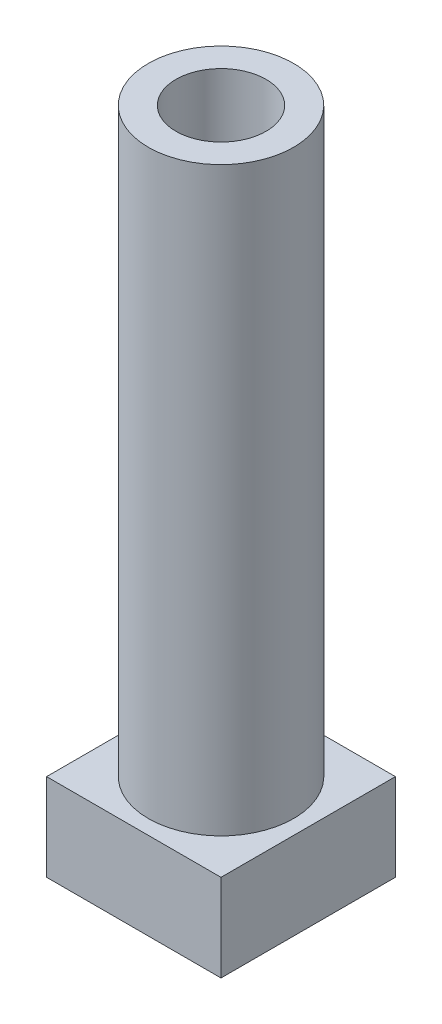
ISO-10303-21;
HEADER;
FILE_DESCRIPTION(('STEP AP214'),'2;1');
FILE_NAME('part.step','',(''),(''),'','','');
FILE_SCHEMA(('AUTOMOTIVE_DESIGN { 1 0 10303 214 1 1 1 1 }'));
ENDSEC;
DATA;
#1=APPLICATION_CONTEXT('core data for automotive mechanical design processes');
#2=APPLICATION_PROTOCOL_DEFINITION('international standard','automotive_design',2000,#1);
#3=PRODUCT_CONTEXT('',#1,'mechanical');
#4=PRODUCT('Part','Part','',(#3));
#5=PRODUCT_RELATED_PRODUCT_CATEGORY('part','',(#4));
#6=PRODUCT_DEFINITION_FORMATION('','',#4);
#7=PRODUCT_DEFINITION_CONTEXT('part definition',#1,'design');
#8=PRODUCT_DEFINITION('design','',#6,#7);
#9=PRODUCT_DEFINITION_SHAPE('','',#8);
#10=(LENGTH_UNIT() NAMED_UNIT(*) SI_UNIT(.MILLI.,.METRE.));
#11=(NAMED_UNIT(*) PLANE_ANGLE_UNIT() SI_UNIT($,.RADIAN.));
#12=(NAMED_UNIT(*) SI_UNIT($,.STERADIAN.) SOLID_ANGLE_UNIT());
#13=UNCERTAINTY_MEASURE_WITH_UNIT(LENGTH_MEASURE(1.E-05),#10,'distance_accuracy_value','');
#14=(GEOMETRIC_REPRESENTATION_CONTEXT(3) GLOBAL_UNCERTAINTY_ASSIGNED_CONTEXT((#13)) GLOBAL_UNIT_ASSIGNED_CONTEXT((#10,
#11,#12)) REPRESENTATION_CONTEXT('',''));
#15=CARTESIAN_POINT('',(0.,0.,0.));
#16=DIRECTION('',(0.,0.,1.));
#17=DIRECTION('',(1.,0.,0.));
#18=AXIS2_PLACEMENT_3D('',#15,#16,#17);
#19=CARTESIAN_POINT('',(0.,-3.,3.));
#20=DIRECTION('',(0.,0.,1.));
#21=DIRECTION('',(1.,0.,0.));
#22=AXIS2_PLACEMENT_3D('',#19,#20,#21);
#23=PLANE('',#22);
#24=DIRECTION('',(1.,0.,0.));
#25=VECTOR('',#24,1.);
#26=CARTESIAN_POINT('',(0.,0.,3.));
#27=LINE('',#26,#25);
#28=CARTESIAN_POINT('',(-3.,0.,3.));
#29=VERTEX_POINT('',#28);
#30=CARTESIAN_POINT('',(3.,0.,3.));
#31=VERTEX_POINT('',#30);
#32=EDGE_CURVE('E113',#29,#31,#27,.T.);
#33=ORIENTED_EDGE('',*,*,#32,.F.);
#34=DIRECTION('',(0.,1.,0.));
#35=VECTOR('',#34,1.);
#36=CARTESIAN_POINT('',(-3.,-3.,3.));
#37=LINE('',#36,#35);
#38=CARTESIAN_POINT('',(-3.,-3.,3.));
#39=VERTEX_POINT('',#38);
#40=EDGE_CURVE('E11',#39,#29,#37,.T.);
#41=ORIENTED_EDGE('',*,*,#40,.F.);
#42=DIRECTION('',(1.,0.,0.));
#43=VECTOR('',#42,1.);
#44=CARTESIAN_POINT('',(0.,-3.,3.));
#45=LINE('',#44,#43);
#46=CARTESIAN_POINT('',(3.,-3.,3.));
#47=VERTEX_POINT('',#46);
#48=EDGE_CURVE('E105',#39,#47,#45,.T.);
#49=ORIENTED_EDGE('',*,*,#48,.T.);
#50=DIRECTION('',(0.,1.,0.));
#51=VECTOR('',#50,1.);
#52=CARTESIAN_POINT('',(3.,-3.,3.));
#53=LINE('',#52,#51);
#54=EDGE_CURVE('E44',#47,#31,#53,.T.);
#55=ORIENTED_EDGE('',*,*,#54,.T.);
#56=EDGE_LOOP('',(#33,#41,#49,#55));
#57=FACE_BOUND('',#56,.T.);
#58=ADVANCED_FACE('F41',(#57),#23,.T.);
#59=CARTESIAN_POINT('',(-3.,-3.,0.));
#60=DIRECTION('',(1.,0.,0.));
#61=DIRECTION('',(0.,0.,-1.));
#62=AXIS2_PLACEMENT_3D('',#59,#60,#61);
#63=PLANE('',#62);
#64=DIRECTION('',(0.,0.,-1.));
#65=VECTOR('',#64,1.);
#66=CARTESIAN_POINT('',(-3.,0.,0.));
#67=LINE('',#66,#65);
#68=CARTESIAN_POINT('',(-3.,0.,-3.));
#69=VERTEX_POINT('',#68);
#70=EDGE_CURVE('E75',#29,#69,#67,.T.);
#71=ORIENTED_EDGE('',*,*,#70,.T.);
#72=DIRECTION('',(0.,1.,0.));
#73=VECTOR('',#72,1.);
#74=CARTESIAN_POINT('',(-3.,-3.,-3.));
#75=LINE('',#74,#73);
#76=CARTESIAN_POINT('',(-3.,-3.,-3.));
#77=VERTEX_POINT('',#76);
#78=EDGE_CURVE('E51',#77,#69,#75,.T.);
#79=ORIENTED_EDGE('',*,*,#78,.F.);
#80=DIRECTION('',(0.,0.,-1.));
#81=VECTOR('',#80,1.);
#82=CARTESIAN_POINT('',(-3.,-3.,0.));
#83=LINE('',#82,#81);
#84=EDGE_CURVE('E92',#39,#77,#83,.T.);
#85=ORIENTED_EDGE('',*,*,#84,.F.);
#86=ORIENTED_EDGE('',*,*,#40,.T.);
#87=EDGE_LOOP('',(#71,#79,#85,#86));
#88=FACE_BOUND('',#87,.T.);
#89=ADVANCED_FACE('F130',(#88),#63,.F.);
#90=CARTESIAN_POINT('',(0.,-3.,-3.));
#91=DIRECTION('',(0.,0.,1.));
#92=DIRECTION('',(1.,0.,0.));
#93=AXIS2_PLACEMENT_3D('',#90,#91,#92);
#94=PLANE('',#93);
#95=DIRECTION('',(1.,0.,0.));
#96=VECTOR('',#95,1.);
#97=CARTESIAN_POINT('',(0.,0.,-3.));
#98=LINE('',#97,#96);
#99=CARTESIAN_POINT('',(3.,0.,-3.));
#100=VERTEX_POINT('',#99);
#101=EDGE_CURVE('E100',#69,#100,#98,.T.);
#102=ORIENTED_EDGE('',*,*,#101,.T.);
#103=DIRECTION('',(0.,1.,0.));
#104=VECTOR('',#103,1.);
#105=CARTESIAN_POINT('',(3.,-3.,-3.));
#106=LINE('',#105,#104);
#107=CARTESIAN_POINT('',(3.,-3.,-3.));
#108=VERTEX_POINT('',#107);
#109=EDGE_CURVE('E97',#108,#100,#106,.T.);
#110=ORIENTED_EDGE('',*,*,#109,.F.);
#111=DIRECTION('',(1.,0.,0.));
#112=VECTOR('',#111,1.);
#113=CARTESIAN_POINT('',(0.,-3.,-3.));
#114=LINE('',#113,#112);
#115=EDGE_CURVE('E87',#77,#108,#114,.T.);
#116=ORIENTED_EDGE('',*,*,#115,.F.);
#117=ORIENTED_EDGE('',*,*,#78,.T.);
#118=EDGE_LOOP('',(#102,#110,#116,#117));
#119=FACE_BOUND('',#118,.T.);
#120=ADVANCED_FACE('F98',(#119),#94,.F.);
#121=CARTESIAN_POINT('',(3.,-3.,0.));
#122=DIRECTION('',(1.,0.,0.));
#123=DIRECTION('',(0.,0.,-1.));
#124=AXIS2_PLACEMENT_3D('',#121,#122,#123);
#125=PLANE('',#124);
#126=DIRECTION('',(0.,0.,-1.));
#127=VECTOR('',#126,1.);
#128=CARTESIAN_POINT('',(3.,0.,0.));
#129=LINE('',#128,#127);
#130=EDGE_CURVE('E117',#31,#100,#129,.T.);
#131=ORIENTED_EDGE('',*,*,#130,.F.);
#132=ORIENTED_EDGE('',*,*,#54,.F.);
#133=DIRECTION('',(0.,0.,-1.));
#134=VECTOR('',#133,1.);
#135=CARTESIAN_POINT('',(3.,-3.,0.));
#136=LINE('',#135,#134);
#137=EDGE_CURVE('E91',#47,#108,#136,.T.);
#138=ORIENTED_EDGE('',*,*,#137,.T.);
#139=ORIENTED_EDGE('',*,*,#109,.T.);
#140=EDGE_LOOP('',(#131,#132,#138,#139));
#141=FACE_BOUND('',#140,.T.);
#142=ADVANCED_FACE('F103',(#141),#125,.T.);
#143=CARTESIAN_POINT('',(0.,-3.,0.));
#144=DIRECTION('',(0.,1.,0.));
#145=DIRECTION('',(0.,0.,1.));
#146=AXIS2_PLACEMENT_3D('',#143,#144,#145);
#147=PLANE('',#146);
#148=ORIENTED_EDGE('',*,*,#48,.F.);
#149=ORIENTED_EDGE('',*,*,#84,.T.);
#150=ORIENTED_EDGE('',*,*,#115,.T.);
#151=ORIENTED_EDGE('',*,*,#137,.F.);
#152=EDGE_LOOP('',(#148,#149,#150,#151));
#153=FACE_BOUND('',#152,.T.);
#154=ADVANCED_FACE('F90',(#153),#147,.F.);
#155=CARTESIAN_POINT('',(0.,0.,0.));
#156=DIRECTION('',(0.,1.,0.));
#157=DIRECTION('',(0.,0.,1.));
#158=AXIS2_PLACEMENT_3D('',#155,#156,#157);
#159=PLANE('',#158);
#160=CARTESIAN_POINT('',(0.,0.,0.));
#161=DIRECTION('',(0.,1.,0.));
#162=DIRECTION('',(0.,0.,1.));
#163=AXIS2_PLACEMENT_3D('',#160,#161,#162);
#164=CIRCLE('',#163,2.5);
#165=CARTESIAN_POINT('',(0.,0.,2.5));
#166=VERTEX_POINT('',#165);
#167=EDGE_CURVE('E179',#166,#166,#164,.T.);
#168=ORIENTED_EDGE('',*,*,#167,.F.);
#169=EDGE_LOOP('',(#168));
#170=FACE_BOUND('',#169,.T.);
#171=ORIENTED_EDGE('',*,*,#32,.T.);
#172=ORIENTED_EDGE('',*,*,#130,.T.);
#173=ORIENTED_EDGE('',*,*,#101,.F.);
#174=ORIENTED_EDGE('',*,*,#70,.F.);
#175=EDGE_LOOP('',(#171,#172,#173,#174));
#176=FACE_BOUND('',#175,.T.);
#177=ADVANCED_FACE('F127',(#170,#176),#159,.T.);
#178=CARTESIAN_POINT('',(0.,20.,0.));
#179=DIRECTION('',(0.,-1.,0.));
#180=DIRECTION('',(0.,0.,-1.));
#181=AXIS2_PLACEMENT_3D('',#178,#179,#180);
#182=CYLINDRICAL_SURFACE('',#181,1.55);
#183=CARTESIAN_POINT('',(0.,3.,0.));
#184=DIRECTION('',(0.,1.,0.));
#185=DIRECTION('',(0.,0.,1.));
#186=AXIS2_PLACEMENT_3D('',#183,#184,#185);
#187=CIRCLE('',#186,1.55);
#188=CARTESIAN_POINT('',(0.,3.,1.55));
#189=VERTEX_POINT('',#188);
#190=EDGE_CURVE('E118',#189,#189,#187,.F.);
#191=ORIENTED_EDGE('',*,*,#190,.T.);
#192=EDGE_LOOP('',(#191));
#193=FACE_BOUND('',#192,.T.);
#194=CARTESIAN_POINT('',(0.,20.,0.));
#195=DIRECTION('',(0.,1.,0.));
#196=DIRECTION('',(0.,0.,1.));
#197=AXIS2_PLACEMENT_3D('',#194,#195,#196);
#198=CIRCLE('',#197,1.55);
#199=CARTESIAN_POINT('',(0.,20.,1.55));
#200=VERTEX_POINT('',#199);
#201=EDGE_CURVE('E170',#200,#200,#198,.T.);
#202=ORIENTED_EDGE('',*,*,#201,.T.);
#203=EDGE_LOOP('',(#202));
#204=FACE_BOUND('',#203,.T.);
#205=ADVANCED_FACE('F148',(#193,#204),#182,.F.);
#206=CARTESIAN_POINT('',(0.,20.,0.));
#207=DIRECTION('',(0.,-1.,0.));
#208=DIRECTION('',(0.,0.,-1.));
#209=AXIS2_PLACEMENT_3D('',#206,#207,#208);
#210=CYLINDRICAL_SURFACE('',#209,2.5);
#211=CARTESIAN_POINT('',(0.,20.,0.));
#212=DIRECTION('',(0.,1.,0.));
#213=DIRECTION('',(0.,0.,1.));
#214=AXIS2_PLACEMENT_3D('',#211,#212,#213);
#215=CIRCLE('',#214,2.5);
#216=CARTESIAN_POINT('',(0.,20.,2.5));
#217=VERTEX_POINT('',#216);
#218=EDGE_CURVE('E173',#217,#217,#215,.T.);
#219=ORIENTED_EDGE('',*,*,#218,.F.);
#220=EDGE_LOOP('',(#219));
#221=FACE_BOUND('',#220,.T.);
#222=ORIENTED_EDGE('',*,*,#167,.T.);
#223=EDGE_LOOP('',(#222));
#224=FACE_BOUND('',#223,.T.);
#225=ADVANCED_FACE('F158',(#221,#224),#210,.T.);
#226=CARTESIAN_POINT('',(0.,20.,0.));
#227=DIRECTION('',(0.,1.,0.));
#228=DIRECTION('',(0.,0.,1.));
#229=AXIS2_PLACEMENT_3D('',#226,#227,#228);
#230=PLANE('',#229);
#231=ORIENTED_EDGE('',*,*,#201,.F.);
#232=EDGE_LOOP('',(#231));
#233=FACE_BOUND('',#232,.T.);
#234=ORIENTED_EDGE('',*,*,#218,.T.);
#235=EDGE_LOOP('',(#234));
#236=FACE_BOUND('',#235,.T.);
#237=ADVANCED_FACE('F154',(#233,#236),#230,.T.);
#238=CARTESIAN_POINT('',(0.,3.,0.));
#239=DIRECTION('',(0.,1.,0.));
#240=DIRECTION('',(0.,0.,1.));
#241=AXIS2_PLACEMENT_3D('',#238,#239,#240);
#242=PLANE('',#241);
#243=ORIENTED_EDGE('',*,*,#190,.F.);
#244=EDGE_LOOP('',(#243));
#245=FACE_BOUND('',#244,.T.);
#246=ADVANCED_FACE('F151',(#245),#242,.T.);
#247=CLOSED_SHELL('',(#58,#89,#120,#142,#154,#177,#205,#225,#237,#246));
#248=MANIFOLD_SOLID_BREP('B2',#247);
#249=ADVANCED_BREP_SHAPE_REPRESENTATION('',(#18,#248),#14);
#250=SHAPE_DEFINITION_REPRESENTATION(#9,#249);
ENDSEC;
END-ISO-10303-21;
